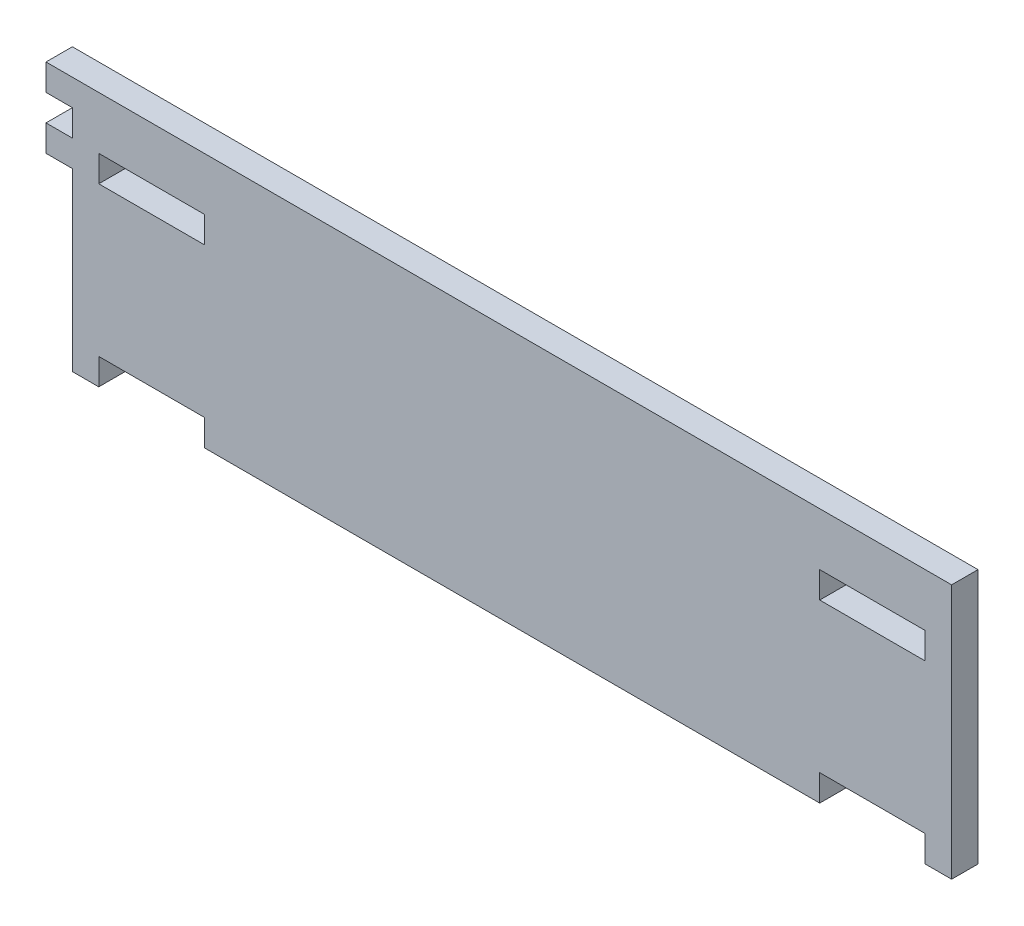
ISO-10303-21;
HEADER;
FILE_DESCRIPTION(('STEP AP214'),'2;1');
FILE_NAME('part.step','',(''),(''),'','','');
FILE_SCHEMA(('AUTOMOTIVE_DESIGN { 1 0 10303 214 1 1 1 1 }'));
ENDSEC;
DATA;
#1=APPLICATION_CONTEXT('core data for automotive mechanical design processes');
#2=APPLICATION_PROTOCOL_DEFINITION('international standard','automotive_design',2000,#1);
#3=PRODUCT_CONTEXT('',#1,'mechanical');
#4=PRODUCT('Part','Part','',(#3));
#5=PRODUCT_RELATED_PRODUCT_CATEGORY('part','',(#4));
#6=PRODUCT_DEFINITION_FORMATION('','',#4);
#7=PRODUCT_DEFINITION_CONTEXT('part definition',#1,'design');
#8=PRODUCT_DEFINITION('design','',#6,#7);
#9=PRODUCT_DEFINITION_SHAPE('','',#8);
#10=(LENGTH_UNIT() NAMED_UNIT(*) SI_UNIT(.MILLI.,.METRE.));
#11=(NAMED_UNIT(*) PLANE_ANGLE_UNIT() SI_UNIT($,.RADIAN.));
#12=(NAMED_UNIT(*) SI_UNIT($,.STERADIAN.) SOLID_ANGLE_UNIT());
#13=UNCERTAINTY_MEASURE_WITH_UNIT(LENGTH_MEASURE(1.E-05),#10,'distance_accuracy_value','');
#14=(GEOMETRIC_REPRESENTATION_CONTEXT(3) GLOBAL_UNCERTAINTY_ASSIGNED_CONTEXT((#13)) GLOBAL_UNIT_ASSIGNED_CONTEXT((#10,
#11,#12)) REPRESENTATION_CONTEXT('',''));
#15=CARTESIAN_POINT('',(0.,0.,0.));
#16=DIRECTION('',(0.,0.,1.));
#17=DIRECTION('',(1.,0.,0.));
#18=AXIS2_PLACEMENT_3D('',#15,#16,#17);
#19=CARTESIAN_POINT('',(0.,0.,3.));
#20=DIRECTION('',(1.,0.,0.));
#21=DIRECTION('',(0.,0.,-1.));
#22=AXIS2_PLACEMENT_3D('',#19,#20,#21);
#23=PLANE('',#22);
#24=DIRECTION('',(0.,0.,1.));
#25=VECTOR('',#24,1.);
#26=CARTESIAN_POINT('',(0.,20.,0.));
#27=LINE('',#26,#25);
#28=CARTESIAN_POINT('',(0.,20.,0.));
#29=VERTEX_POINT('',#28);
#30=CARTESIAN_POINT('',(0.,20.,3.));
#31=VERTEX_POINT('',#30);
#32=EDGE_CURVE('E259',#29,#31,#27,.T.);
#33=ORIENTED_EDGE('',*,*,#32,.F.);
#34=DIRECTION('',(0.,-1.,0.));
#35=VECTOR('',#34,1.);
#36=CARTESIAN_POINT('',(0.,0.,0.));
#37=LINE('',#36,#35);
#38=CARTESIAN_POINT('',(0.,0.,0.));
#39=VERTEX_POINT('',#38);
#40=EDGE_CURVE('E328',#29,#39,#37,.T.);
#41=ORIENTED_EDGE('',*,*,#40,.T.);
#42=DIRECTION('',(0.,0.,-1.));
#43=VECTOR('',#42,1.);
#44=CARTESIAN_POINT('',(0.,0.,3.));
#45=LINE('',#44,#43);
#46=CARTESIAN_POINT('',(0.,0.,3.));
#47=VERTEX_POINT('',#46);
#48=EDGE_CURVE('E11',#47,#39,#45,.T.);
#49=ORIENTED_EDGE('',*,*,#48,.F.);
#50=DIRECTION('',(0.,-1.,0.));
#51=VECTOR('',#50,1.);
#52=CARTESIAN_POINT('',(0.,0.,3.));
#53=LINE('',#52,#51);
#54=EDGE_CURVE('E216',#31,#47,#53,.T.);
#55=ORIENTED_EDGE('',*,*,#54,.F.);
#56=EDGE_LOOP('',(#33,#41,#49,#55));
#57=FACE_BOUND('',#56,.T.);
#58=ADVANCED_FACE('F33',(#57),#23,.F.);
#59=CARTESIAN_POINT('',(0.,0.,3.));
#60=DIRECTION('',(0.,0.,-1.));
#61=DIRECTION('',(-1.,0.,0.));
#62=AXIS2_PLACEMENT_3D('',#59,#60,#61);
#63=PLANE('',#62);
#64=DIRECTION('',(0.,-1.,0.));
#65=VECTOR('',#64,1.);
#66=CARTESIAN_POINT('',(3.,23.,3.));
#67=LINE('',#66,#65);
#68=CARTESIAN_POINT('',(3.,23.,3.));
#69=VERTEX_POINT('',#68);
#70=CARTESIAN_POINT('',(3.,20.,3.));
#71=VERTEX_POINT('',#70);
#72=EDGE_CURVE('E298',#69,#71,#67,.T.);
#73=ORIENTED_EDGE('',*,*,#72,.F.);
#74=DIRECTION('',(-1.,0.,0.));
#75=VECTOR('',#74,1.);
#76=CARTESIAN_POINT('',(3.,23.,3.));
#77=LINE('',#76,#75);
#78=CARTESIAN_POINT('',(15.,23.,3.));
#79=VERTEX_POINT('',#78);
#80=EDGE_CURVE('E306',#79,#69,#77,.T.);
#81=ORIENTED_EDGE('',*,*,#80,.F.);
#82=DIRECTION('',(0.,1.,0.));
#83=VECTOR('',#82,1.);
#84=CARTESIAN_POINT('',(15.,23.,3.));
#85=LINE('',#84,#83);
#86=CARTESIAN_POINT('',(15.,20.,3.));
#87=VERTEX_POINT('',#86);
#88=EDGE_CURVE('E303',#87,#79,#85,.T.);
#89=ORIENTED_EDGE('',*,*,#88,.F.);
#90=DIRECTION('',(1.,0.,0.));
#91=VECTOR('',#90,1.);
#92=CARTESIAN_POINT('',(3.,20.,3.));
#93=LINE('',#92,#91);
#94=EDGE_CURVE('E300',#71,#87,#93,.T.);
#95=ORIENTED_EDGE('',*,*,#94,.F.);
#96=EDGE_LOOP('',(#73,#81,#89,#95));
#97=FACE_BOUND('',#96,.T.);
#98=DIRECTION('',(-1.,0.,0.));
#99=VECTOR('',#98,1.);
#100=CARTESIAN_POINT('',(0.,29.,3.));
#101=LINE('',#100,#99);
#102=CARTESIAN_POINT('',(100.,29.,3.));
#103=VERTEX_POINT('',#102);
#104=CARTESIAN_POINT('',(-3.,29.,3.));
#105=VERTEX_POINT('',#104);
#106=EDGE_CURVE('E350',#103,#105,#101,.T.);
#107=ORIENTED_EDGE('',*,*,#106,.T.);
#108=DIRECTION('',(0.,-1.,0.));
#109=VECTOR('',#108,1.);
#110=CARTESIAN_POINT('',(-3.,29.,3.));
#111=LINE('',#110,#109);
#112=CARTESIAN_POINT('',(-3.,26.,3.));
#113=VERTEX_POINT('',#112);
#114=EDGE_CURVE('E225',#105,#113,#111,.T.);
#115=ORIENTED_EDGE('',*,*,#114,.T.);
#116=DIRECTION('',(1.,0.,0.));
#117=VECTOR('',#116,1.);
#118=CARTESIAN_POINT('',(0.,26.,3.));
#119=LINE('',#118,#117);
#120=CARTESIAN_POINT('',(0.,26.,3.));
#121=VERTEX_POINT('',#120);
#122=EDGE_CURVE('E232',#113,#121,#119,.T.);
#123=ORIENTED_EDGE('',*,*,#122,.T.);
#124=CARTESIAN_POINT('',(0.,23.,3.));
#125=VERTEX_POINT('',#124);
#126=EDGE_CURVE('E48',#121,#125,#53,.T.);
#127=ORIENTED_EDGE('',*,*,#126,.T.);
#128=DIRECTION('',(-1.,0.,0.));
#129=VECTOR('',#128,1.);
#130=CARTESIAN_POINT('',(0.,23.,3.));
#131=LINE('',#130,#129);
#132=CARTESIAN_POINT('',(-3.,23.,3.));
#133=VERTEX_POINT('',#132);
#134=EDGE_CURVE('E240',#125,#133,#131,.T.);
#135=ORIENTED_EDGE('',*,*,#134,.T.);
#136=DIRECTION('',(0.,-1.,0.));
#137=VECTOR('',#136,1.);
#138=CARTESIAN_POINT('',(-3.,23.,3.));
#139=LINE('',#138,#137);
#140=CARTESIAN_POINT('',(-3.,20.,3.));
#141=VERTEX_POINT('',#140);
#142=EDGE_CURVE('E254',#133,#141,#139,.T.);
#143=ORIENTED_EDGE('',*,*,#142,.T.);
#144=DIRECTION('',(1.,0.,0.));
#145=VECTOR('',#144,1.);
#146=CARTESIAN_POINT('',(0.,20.,3.));
#147=LINE('',#146,#145);
#148=EDGE_CURVE('E246',#141,#31,#147,.T.);
#149=ORIENTED_EDGE('',*,*,#148,.T.);
#150=ORIENTED_EDGE('',*,*,#54,.T.);
#151=DIRECTION('',(1.,0.,0.));
#152=VECTOR('',#151,1.);
#153=CARTESIAN_POINT('',(0.,0.,3.));
#154=LINE('',#153,#152);
#155=CARTESIAN_POINT('',(3.,0.,3.));
#156=VERTEX_POINT('',#155);
#157=EDGE_CURVE('E330',#47,#156,#154,.T.);
#158=ORIENTED_EDGE('',*,*,#157,.T.);
#159=DIRECTION('',(0.,1.,0.));
#160=VECTOR('',#159,1.);
#161=CARTESIAN_POINT('',(3.,0.,3.));
#162=LINE('',#161,#160);
#163=CARTESIAN_POINT('',(3.,3.,3.));
#164=VERTEX_POINT('',#163);
#165=EDGE_CURVE('E332',#156,#164,#162,.T.);
#166=ORIENTED_EDGE('',*,*,#165,.T.);
#167=DIRECTION('',(1.,0.,0.));
#168=VECTOR('',#167,1.);
#169=CARTESIAN_POINT('',(3.,3.,3.));
#170=LINE('',#169,#168);
#171=CARTESIAN_POINT('',(15.,3.,3.));
#172=VERTEX_POINT('',#171);
#173=EDGE_CURVE('E334',#164,#172,#170,.T.);
#174=ORIENTED_EDGE('',*,*,#173,.T.);
#175=DIRECTION('',(0.,-1.,0.));
#176=VECTOR('',#175,1.);
#177=CARTESIAN_POINT('',(15.,0.,3.));
#178=LINE('',#177,#176);
#179=CARTESIAN_POINT('',(15.,0.,3.));
#180=VERTEX_POINT('',#179);
#181=EDGE_CURVE('E336',#172,#180,#178,.T.);
#182=ORIENTED_EDGE('',*,*,#181,.T.);
#183=DIRECTION('',(1.,0.,0.));
#184=VECTOR('',#183,1.);
#185=CARTESIAN_POINT('',(15.,0.,3.));
#186=LINE('',#185,#184);
#187=CARTESIAN_POINT('',(85.,0.,3.));
#188=VERTEX_POINT('',#187);
#189=EDGE_CURVE('E338',#180,#188,#186,.T.);
#190=ORIENTED_EDGE('',*,*,#189,.T.);
#191=DIRECTION('',(0.,1.,0.));
#192=VECTOR('',#191,1.);
#193=CARTESIAN_POINT('',(85.,0.,3.));
#194=LINE('',#193,#192);
#195=CARTESIAN_POINT('',(85.,3.,3.));
#196=VERTEX_POINT('',#195);
#197=EDGE_CURVE('E340',#188,#196,#194,.T.);
#198=ORIENTED_EDGE('',*,*,#197,.T.);
#199=DIRECTION('',(1.,0.,0.));
#200=VECTOR('',#199,1.);
#201=CARTESIAN_POINT('',(85.,3.,3.));
#202=LINE('',#201,#200);
#203=CARTESIAN_POINT('',(97.,3.,3.));
#204=VERTEX_POINT('',#203);
#205=EDGE_CURVE('E342',#196,#204,#202,.T.);
#206=ORIENTED_EDGE('',*,*,#205,.T.);
#207=DIRECTION('',(0.,-1.,0.));
#208=VECTOR('',#207,1.);
#209=CARTESIAN_POINT('',(97.,0.,3.));
#210=LINE('',#209,#208);
#211=CARTESIAN_POINT('',(97.,0.,3.));
#212=VERTEX_POINT('',#211);
#213=EDGE_CURVE('E344',#204,#212,#210,.T.);
#214=ORIENTED_EDGE('',*,*,#213,.T.);
#215=DIRECTION('',(1.,0.,0.));
#216=VECTOR('',#215,1.);
#217=CARTESIAN_POINT('',(97.,0.,3.));
#218=LINE('',#217,#216);
#219=CARTESIAN_POINT('',(100.,0.,3.));
#220=VERTEX_POINT('',#219);
#221=EDGE_CURVE('E346',#212,#220,#218,.T.);
#222=ORIENTED_EDGE('',*,*,#221,.T.);
#223=DIRECTION('',(0.,1.,0.));
#224=VECTOR('',#223,1.);
#225=CARTESIAN_POINT('',(100.,0.,3.));
#226=LINE('',#225,#224);
#227=EDGE_CURVE('E348',#220,#103,#226,.T.);
#228=ORIENTED_EDGE('',*,*,#227,.T.);
#229=EDGE_LOOP('',(#107,#115,#123,#127,#135,#143,#149,#150,#158,#166,#174,#182,#190,#198,#206,
#214,#222,#228));
#230=FACE_BOUND('',#229,.T.);
#231=DIRECTION('',(0.,-1.,0.));
#232=VECTOR('',#231,1.);
#233=CARTESIAN_POINT('',(85.,23.,3.));
#234=LINE('',#233,#232);
#235=CARTESIAN_POINT('',(85.,23.,3.));
#236=VERTEX_POINT('',#235);
#237=CARTESIAN_POINT('',(85.,20.,3.));
#238=VERTEX_POINT('',#237);
#239=EDGE_CURVE('E267',#236,#238,#234,.T.);
#240=ORIENTED_EDGE('',*,*,#239,.F.);
#241=DIRECTION('',(-1.,0.,0.));
#242=VECTOR('',#241,1.);
#243=CARTESIAN_POINT('',(85.,23.,3.));
#244=LINE('',#243,#242);
#245=CARTESIAN_POINT('',(97.,23.,3.));
#246=VERTEX_POINT('',#245);
#247=EDGE_CURVE('E275',#246,#236,#244,.T.);
#248=ORIENTED_EDGE('',*,*,#247,.F.);
#249=DIRECTION('',(0.,1.,0.));
#250=VECTOR('',#249,1.);
#251=CARTESIAN_POINT('',(97.,23.,3.));
#252=LINE('',#251,#250);
#253=CARTESIAN_POINT('',(97.,20.,3.));
#254=VERTEX_POINT('',#253);
#255=EDGE_CURVE('E272',#254,#246,#252,.T.);
#256=ORIENTED_EDGE('',*,*,#255,.F.);
#257=DIRECTION('',(1.,0.,0.));
#258=VECTOR('',#257,1.);
#259=CARTESIAN_POINT('',(85.,20.,3.));
#260=LINE('',#259,#258);
#261=EDGE_CURVE('E269',#238,#254,#260,.T.);
#262=ORIENTED_EDGE('',*,*,#261,.F.);
#263=EDGE_LOOP('',(#240,#248,#256,#262));
#264=FACE_BOUND('',#263,.T.);
#265=ADVANCED_FACE('F421',(#97,#230,#264),#63,.F.);
#266=CARTESIAN_POINT('',(0.,0.,0.));
#267=DIRECTION('',(0.,0.,-1.));
#268=DIRECTION('',(-1.,0.,0.));
#269=AXIS2_PLACEMENT_3D('',#266,#267,#268);
#270=PLANE('',#269);
#271=CARTESIAN_POINT('',(0.,26.,0.));
#272=VERTEX_POINT('',#271);
#273=CARTESIAN_POINT('',(0.,23.,0.));
#274=VERTEX_POINT('',#273);
#275=EDGE_CURVE('E352',#272,#274,#37,.T.);
#276=ORIENTED_EDGE('',*,*,#275,.F.);
#277=DIRECTION('',(1.,0.,0.));
#278=VECTOR('',#277,1.);
#279=CARTESIAN_POINT('',(0.,26.,0.));
#280=LINE('',#279,#278);
#281=CARTESIAN_POINT('',(-3.,26.,0.));
#282=VERTEX_POINT('',#281);
#283=EDGE_CURVE('E227',#282,#272,#280,.T.);
#284=ORIENTED_EDGE('',*,*,#283,.F.);
#285=DIRECTION('',(0.,-1.,0.));
#286=VECTOR('',#285,1.);
#287=CARTESIAN_POINT('',(-3.,29.,0.));
#288=LINE('',#287,#286);
#289=CARTESIAN_POINT('',(-3.,29.,0.));
#290=VERTEX_POINT('',#289);
#291=EDGE_CURVE('E222',#290,#282,#288,.T.);
#292=ORIENTED_EDGE('',*,*,#291,.F.);
#293=DIRECTION('',(-1.,0.,0.));
#294=VECTOR('',#293,1.);
#295=CARTESIAN_POINT('',(0.,29.,0.));
#296=LINE('',#295,#294);
#297=CARTESIAN_POINT('',(100.,29.,0.));
#298=VERTEX_POINT('',#297);
#299=EDGE_CURVE('E205',#298,#290,#296,.T.);
#300=ORIENTED_EDGE('',*,*,#299,.F.);
#301=DIRECTION('',(0.,1.,0.));
#302=VECTOR('',#301,1.);
#303=CARTESIAN_POINT('',(100.,0.,0.));
#304=LINE('',#303,#302);
#305=CARTESIAN_POINT('',(100.,0.,0.));
#306=VERTEX_POINT('',#305);
#307=EDGE_CURVE('E217',#306,#298,#304,.T.);
#308=ORIENTED_EDGE('',*,*,#307,.F.);
#309=DIRECTION('',(1.,0.,0.));
#310=VECTOR('',#309,1.);
#311=CARTESIAN_POINT('',(97.,0.,0.));
#312=LINE('',#311,#310);
#313=CARTESIAN_POINT('',(97.,0.,0.));
#314=VERTEX_POINT('',#313);
#315=EDGE_CURVE('E370',#314,#306,#312,.T.);
#316=ORIENTED_EDGE('',*,*,#315,.F.);
#317=DIRECTION('',(0.,-1.,0.));
#318=VECTOR('',#317,1.);
#319=CARTESIAN_POINT('',(97.,0.,0.));
#320=LINE('',#319,#318);
#321=CARTESIAN_POINT('',(97.,3.,0.));
#322=VERTEX_POINT('',#321);
#323=EDGE_CURVE('E368',#322,#314,#320,.T.);
#324=ORIENTED_EDGE('',*,*,#323,.F.);
#325=DIRECTION('',(1.,0.,0.));
#326=VECTOR('',#325,1.);
#327=CARTESIAN_POINT('',(85.,3.,0.));
#328=LINE('',#327,#326);
#329=CARTESIAN_POINT('',(85.,3.,0.));
#330=VERTEX_POINT('',#329);
#331=EDGE_CURVE('E366',#330,#322,#328,.T.);
#332=ORIENTED_EDGE('',*,*,#331,.F.);
#333=DIRECTION('',(0.,1.,0.));
#334=VECTOR('',#333,1.);
#335=CARTESIAN_POINT('',(85.,0.,0.));
#336=LINE('',#335,#334);
#337=CARTESIAN_POINT('',(85.,0.,0.));
#338=VERTEX_POINT('',#337);
#339=EDGE_CURVE('E364',#338,#330,#336,.T.);
#340=ORIENTED_EDGE('',*,*,#339,.F.);
#341=DIRECTION('',(1.,0.,0.));
#342=VECTOR('',#341,1.);
#343=CARTESIAN_POINT('',(15.,0.,0.));
#344=LINE('',#343,#342);
#345=CARTESIAN_POINT('',(15.,0.,0.));
#346=VERTEX_POINT('',#345);
#347=EDGE_CURVE('E362',#346,#338,#344,.T.);
#348=ORIENTED_EDGE('',*,*,#347,.F.);
#349=DIRECTION('',(0.,-1.,0.));
#350=VECTOR('',#349,1.);
#351=CARTESIAN_POINT('',(15.,0.,0.));
#352=LINE('',#351,#350);
#353=CARTESIAN_POINT('',(15.,3.,0.));
#354=VERTEX_POINT('',#353);
#355=EDGE_CURVE('E360',#354,#346,#352,.T.);
#356=ORIENTED_EDGE('',*,*,#355,.F.);
#357=DIRECTION('',(1.,0.,0.));
#358=VECTOR('',#357,1.);
#359=CARTESIAN_POINT('',(3.,3.,0.));
#360=LINE('',#359,#358);
#361=CARTESIAN_POINT('',(3.,3.,0.));
#362=VERTEX_POINT('',#361);
#363=EDGE_CURVE('E358',#362,#354,#360,.T.);
#364=ORIENTED_EDGE('',*,*,#363,.F.);
#365=DIRECTION('',(0.,1.,0.));
#366=VECTOR('',#365,1.);
#367=CARTESIAN_POINT('',(3.,0.,0.));
#368=LINE('',#367,#366);
#369=CARTESIAN_POINT('',(3.,0.,0.));
#370=VERTEX_POINT('',#369);
#371=EDGE_CURVE('E356',#370,#362,#368,.T.);
#372=ORIENTED_EDGE('',*,*,#371,.F.);
#373=DIRECTION('',(1.,0.,0.));
#374=VECTOR('',#373,1.);
#375=CARTESIAN_POINT('',(0.,0.,0.));
#376=LINE('',#375,#374);
#377=EDGE_CURVE('E354',#39,#370,#376,.T.);
#378=ORIENTED_EDGE('',*,*,#377,.F.);
#379=ORIENTED_EDGE('',*,*,#40,.F.);
#380=DIRECTION('',(1.,0.,0.));
#381=VECTOR('',#380,1.);
#382=CARTESIAN_POINT('',(0.,20.,0.));
#383=LINE('',#382,#381);
#384=CARTESIAN_POINT('',(-3.,20.,0.));
#385=VERTEX_POINT('',#384);
#386=EDGE_CURVE('E249',#385,#29,#383,.T.);
#387=ORIENTED_EDGE('',*,*,#386,.F.);
#388=DIRECTION('',(0.,-1.,0.));
#389=VECTOR('',#388,1.);
#390=CARTESIAN_POINT('',(-3.,23.,0.));
#391=LINE('',#390,#389);
#392=CARTESIAN_POINT('',(-3.,23.,0.));
#393=VERTEX_POINT('',#392);
#394=EDGE_CURVE('E245',#393,#385,#391,.T.);
#395=ORIENTED_EDGE('',*,*,#394,.F.);
#396=DIRECTION('',(-1.,0.,0.));
#397=VECTOR('',#396,1.);
#398=CARTESIAN_POINT('',(0.,23.,0.));
#399=LINE('',#398,#397);
#400=EDGE_CURVE('E242',#274,#393,#399,.T.);
#401=ORIENTED_EDGE('',*,*,#400,.F.);
#402=EDGE_LOOP('',(#276,#284,#292,#300,#308,#316,#324,#332,#340,#348,#356,#364,#372,#378,#379,
#387,#395,#401));
#403=FACE_BOUND('',#402,.T.);
#404=DIRECTION('',(-1.,0.,0.));
#405=VECTOR('',#404,1.);
#406=CARTESIAN_POINT('',(3.,23.,0.));
#407=LINE('',#406,#405);
#408=CARTESIAN_POINT('',(15.,23.,0.));
#409=VERTEX_POINT('',#408);
#410=CARTESIAN_POINT('',(3.,23.,0.));
#411=VERTEX_POINT('',#410);
#412=EDGE_CURVE('E301',#409,#411,#407,.T.);
#413=ORIENTED_EDGE('',*,*,#412,.T.);
#414=DIRECTION('',(0.,-1.,0.));
#415=VECTOR('',#414,1.);
#416=CARTESIAN_POINT('',(3.,23.,0.));
#417=LINE('',#416,#415);
#418=CARTESIAN_POINT('',(3.,20.,0.));
#419=VERTEX_POINT('',#418);
#420=EDGE_CURVE('E297',#411,#419,#417,.T.);
#421=ORIENTED_EDGE('',*,*,#420,.T.);
#422=DIRECTION('',(1.,0.,0.));
#423=VECTOR('',#422,1.);
#424=CARTESIAN_POINT('',(3.,20.,0.));
#425=LINE('',#424,#423);
#426=CARTESIAN_POINT('',(15.,20.,0.));
#427=VERTEX_POINT('',#426);
#428=EDGE_CURVE('E311',#419,#427,#425,.T.);
#429=ORIENTED_EDGE('',*,*,#428,.T.);
#430=DIRECTION('',(0.,1.,0.));
#431=VECTOR('',#430,1.);
#432=CARTESIAN_POINT('',(15.,23.,0.));
#433=LINE('',#432,#431);
#434=EDGE_CURVE('E314',#427,#409,#433,.T.);
#435=ORIENTED_EDGE('',*,*,#434,.T.);
#436=EDGE_LOOP('',(#413,#421,#429,#435));
#437=FACE_BOUND('',#436,.T.);
#438=DIRECTION('',(-1.,0.,0.));
#439=VECTOR('',#438,1.);
#440=CARTESIAN_POINT('',(85.,23.,0.));
#441=LINE('',#440,#439);
#442=CARTESIAN_POINT('',(97.,23.,0.));
#443=VERTEX_POINT('',#442);
#444=CARTESIAN_POINT('',(85.,23.,0.));
#445=VERTEX_POINT('',#444);
#446=EDGE_CURVE('E270',#443,#445,#441,.T.);
#447=ORIENTED_EDGE('',*,*,#446,.T.);
#448=DIRECTION('',(0.,-1.,0.));
#449=VECTOR('',#448,1.);
#450=CARTESIAN_POINT('',(85.,23.,0.));
#451=LINE('',#450,#449);
#452=CARTESIAN_POINT('',(85.,20.,0.));
#453=VERTEX_POINT('',#452);
#454=EDGE_CURVE('E261',#445,#453,#451,.T.);
#455=ORIENTED_EDGE('',*,*,#454,.T.);
#456=DIRECTION('',(1.,0.,0.));
#457=VECTOR('',#456,1.);
#458=CARTESIAN_POINT('',(85.,20.,0.));
#459=LINE('',#458,#457);
#460=CARTESIAN_POINT('',(97.,20.,0.));
#461=VERTEX_POINT('',#460);
#462=EDGE_CURVE('E280',#453,#461,#459,.T.);
#463=ORIENTED_EDGE('',*,*,#462,.T.);
#464=DIRECTION('',(0.,1.,0.));
#465=VECTOR('',#464,1.);
#466=CARTESIAN_POINT('',(97.,23.,0.));
#467=LINE('',#466,#465);
#468=EDGE_CURVE('E283',#461,#443,#467,.T.);
#469=ORIENTED_EDGE('',*,*,#468,.T.);
#470=EDGE_LOOP('',(#447,#455,#463,#469));
#471=FACE_BOUND('',#470,.T.);
#472=ADVANCED_FACE('F229',(#403,#437,#471),#270,.T.);
#473=ORIENTED_EDGE('',*,*,#126,.F.);
#474=DIRECTION('',(0.,0.,1.));
#475=VECTOR('',#474,1.);
#476=CARTESIAN_POINT('',(0.,26.,0.));
#477=LINE('',#476,#475);
#478=EDGE_CURVE('E52',#272,#121,#477,.T.);
#479=ORIENTED_EDGE('',*,*,#478,.F.);
#480=ORIENTED_EDGE('',*,*,#275,.T.);
#481=DIRECTION('',(0.,0.,1.));
#482=VECTOR('',#481,1.);
#483=CARTESIAN_POINT('',(0.,23.,0.));
#484=LINE('',#483,#482);
#485=EDGE_CURVE('E251',#274,#125,#484,.T.);
#486=ORIENTED_EDGE('',*,*,#485,.T.);
#487=EDGE_LOOP('',(#473,#479,#480,#486));
#488=FACE_BOUND('',#487,.T.);
#489=ADVANCED_FACE('F35',(#488),#23,.F.);
#490=CARTESIAN_POINT('',(0.,0.,3.));
#491=DIRECTION('',(0.,1.,0.));
#492=DIRECTION('',(0.,0.,1.));
#493=AXIS2_PLACEMENT_3D('',#490,#491,#492);
#494=PLANE('',#493);
#495=ORIENTED_EDGE('',*,*,#377,.T.);
#496=DIRECTION('',(0.,0.,-1.));
#497=VECTOR('',#496,1.);
#498=CARTESIAN_POINT('',(3.,0.,3.));
#499=LINE('',#498,#497);
#500=EDGE_CURVE('E41',#156,#370,#499,.T.);
#501=ORIENTED_EDGE('',*,*,#500,.F.);
#502=ORIENTED_EDGE('',*,*,#157,.F.);
#503=ORIENTED_EDGE('',*,*,#48,.T.);
#504=EDGE_LOOP('',(#495,#501,#502,#503));
#505=FACE_BOUND('',#504,.T.);
#506=ADVANCED_FACE('F426',(#505),#494,.F.);
#507=CARTESIAN_POINT('',(3.,0.,3.));
#508=DIRECTION('',(-1.,0.,0.));
#509=DIRECTION('',(0.,0.,1.));
#510=AXIS2_PLACEMENT_3D('',#507,#508,#509);
#511=PLANE('',#510);
#512=ORIENTED_EDGE('',*,*,#371,.T.);
#513=DIRECTION('',(0.,0.,-1.));
#514=VECTOR('',#513,1.);
#515=CARTESIAN_POINT('',(3.,3.,3.));
#516=LINE('',#515,#514);
#517=EDGE_CURVE('E395',#164,#362,#516,.T.);
#518=ORIENTED_EDGE('',*,*,#517,.F.);
#519=ORIENTED_EDGE('',*,*,#165,.F.);
#520=ORIENTED_EDGE('',*,*,#500,.T.);
#521=EDGE_LOOP('',(#512,#518,#519,#520));
#522=FACE_BOUND('',#521,.T.);
#523=ADVANCED_FACE('F402',(#522),#511,.F.);
#524=CARTESIAN_POINT('',(3.,3.,3.));
#525=DIRECTION('',(0.,1.,0.));
#526=DIRECTION('',(0.,0.,1.));
#527=AXIS2_PLACEMENT_3D('',#524,#525,#526);
#528=PLANE('',#527);
#529=ORIENTED_EDGE('',*,*,#363,.T.);
#530=DIRECTION('',(0.,0.,-1.));
#531=VECTOR('',#530,1.);
#532=CARTESIAN_POINT('',(15.,3.,3.));
#533=LINE('',#532,#531);
#534=EDGE_CURVE('E392',#172,#354,#533,.T.);
#535=ORIENTED_EDGE('',*,*,#534,.F.);
#536=ORIENTED_EDGE('',*,*,#173,.F.);
#537=ORIENTED_EDGE('',*,*,#517,.T.);
#538=EDGE_LOOP('',(#529,#535,#536,#537));
#539=FACE_BOUND('',#538,.T.);
#540=ADVANCED_FACE('F413',(#539),#528,.F.);
#541=CARTESIAN_POINT('',(15.,0.,3.));
#542=DIRECTION('',(1.,0.,0.));
#543=DIRECTION('',(0.,0.,-1.));
#544=AXIS2_PLACEMENT_3D('',#541,#542,#543);
#545=PLANE('',#544);
#546=ORIENTED_EDGE('',*,*,#355,.T.);
#547=DIRECTION('',(0.,0.,-1.));
#548=VECTOR('',#547,1.);
#549=CARTESIAN_POINT('',(15.,0.,3.));
#550=LINE('',#549,#548);
#551=EDGE_CURVE('E389',#180,#346,#550,.T.);
#552=ORIENTED_EDGE('',*,*,#551,.F.);
#553=ORIENTED_EDGE('',*,*,#181,.F.);
#554=ORIENTED_EDGE('',*,*,#534,.T.);
#555=EDGE_LOOP('',(#546,#552,#553,#554));
#556=FACE_BOUND('',#555,.T.);
#557=ADVANCED_FACE('F417',(#556),#545,.F.);
#558=CARTESIAN_POINT('',(15.,0.,3.));
#559=DIRECTION('',(0.,1.,0.));
#560=DIRECTION('',(0.,0.,1.));
#561=AXIS2_PLACEMENT_3D('',#558,#559,#560);
#562=PLANE('',#561);
#563=ORIENTED_EDGE('',*,*,#347,.T.);
#564=DIRECTION('',(0.,0.,-1.));
#565=VECTOR('',#564,1.);
#566=CARTESIAN_POINT('',(85.,0.,3.));
#567=LINE('',#566,#565);
#568=EDGE_CURVE('E386',#188,#338,#567,.T.);
#569=ORIENTED_EDGE('',*,*,#568,.F.);
#570=ORIENTED_EDGE('',*,*,#189,.F.);
#571=ORIENTED_EDGE('',*,*,#551,.T.);
#572=EDGE_LOOP('',(#563,#569,#570,#571));
#573=FACE_BOUND('',#572,.T.);
#574=ADVANCED_FACE('F469',(#573),#562,.F.);
#575=CARTESIAN_POINT('',(85.,0.,3.));
#576=DIRECTION('',(-1.,0.,0.));
#577=DIRECTION('',(0.,0.,1.));
#578=AXIS2_PLACEMENT_3D('',#575,#576,#577);
#579=PLANE('',#578);
#580=ORIENTED_EDGE('',*,*,#339,.T.);
#581=DIRECTION('',(0.,0.,-1.));
#582=VECTOR('',#581,1.);
#583=CARTESIAN_POINT('',(85.,3.,3.));
#584=LINE('',#583,#582);
#585=EDGE_CURVE('E383',#196,#330,#584,.T.);
#586=ORIENTED_EDGE('',*,*,#585,.F.);
#587=ORIENTED_EDGE('',*,*,#197,.F.);
#588=ORIENTED_EDGE('',*,*,#568,.T.);
#589=EDGE_LOOP('',(#580,#586,#587,#588));
#590=FACE_BOUND('',#589,.T.);
#591=ADVANCED_FACE('F466',(#590),#579,.F.);
#592=CARTESIAN_POINT('',(85.,3.,3.));
#593=DIRECTION('',(0.,1.,0.));
#594=DIRECTION('',(0.,0.,1.));
#595=AXIS2_PLACEMENT_3D('',#592,#593,#594);
#596=PLANE('',#595);
#597=ORIENTED_EDGE('',*,*,#331,.T.);
#598=DIRECTION('',(0.,0.,-1.));
#599=VECTOR('',#598,1.);
#600=CARTESIAN_POINT('',(97.,3.,3.));
#601=LINE('',#600,#599);
#602=EDGE_CURVE('E380',#204,#322,#601,.T.);
#603=ORIENTED_EDGE('',*,*,#602,.F.);
#604=ORIENTED_EDGE('',*,*,#205,.F.);
#605=ORIENTED_EDGE('',*,*,#585,.T.);
#606=EDGE_LOOP('',(#597,#603,#604,#605));
#607=FACE_BOUND('',#606,.T.);
#608=ADVANCED_FACE('F462',(#607),#596,.F.);
#609=CARTESIAN_POINT('',(97.,0.,3.));
#610=DIRECTION('',(1.,0.,0.));
#611=DIRECTION('',(0.,0.,-1.));
#612=AXIS2_PLACEMENT_3D('',#609,#610,#611);
#613=PLANE('',#612);
#614=ORIENTED_EDGE('',*,*,#323,.T.);
#615=DIRECTION('',(0.,0.,-1.));
#616=VECTOR('',#615,1.);
#617=CARTESIAN_POINT('',(97.,0.,3.));
#618=LINE('',#617,#616);
#619=EDGE_CURVE('E377',#212,#314,#618,.T.);
#620=ORIENTED_EDGE('',*,*,#619,.F.);
#621=ORIENTED_EDGE('',*,*,#213,.F.);
#622=ORIENTED_EDGE('',*,*,#602,.T.);
#623=EDGE_LOOP('',(#614,#620,#621,#622));
#624=FACE_BOUND('',#623,.T.);
#625=ADVANCED_FACE('F458',(#624),#613,.F.);
#626=CARTESIAN_POINT('',(97.,0.,3.));
#627=DIRECTION('',(0.,1.,0.));
#628=DIRECTION('',(0.,0.,1.));
#629=AXIS2_PLACEMENT_3D('',#626,#627,#628);
#630=PLANE('',#629);
#631=ORIENTED_EDGE('',*,*,#315,.T.);
#632=DIRECTION('',(0.,0.,-1.));
#633=VECTOR('',#632,1.);
#634=CARTESIAN_POINT('',(100.,0.,3.));
#635=LINE('',#634,#633);
#636=EDGE_CURVE('E374',#220,#306,#635,.T.);
#637=ORIENTED_EDGE('',*,*,#636,.F.);
#638=ORIENTED_EDGE('',*,*,#221,.F.);
#639=ORIENTED_EDGE('',*,*,#619,.T.);
#640=EDGE_LOOP('',(#631,#637,#638,#639));
#641=FACE_BOUND('',#640,.T.);
#642=ADVANCED_FACE('F454',(#641),#630,.F.);
#643=CARTESIAN_POINT('',(100.,0.,3.));
#644=DIRECTION('',(-1.,0.,0.));
#645=DIRECTION('',(0.,-1.,0.));
#646=AXIS2_PLACEMENT_3D('',#643,#644,#645);
#647=PLANE('',#646);
#648=ORIENTED_EDGE('',*,*,#307,.T.);
#649=DIRECTION('',(0.,0.,-1.));
#650=VECTOR('',#649,1.);
#651=CARTESIAN_POINT('',(100.,29.,3.));
#652=LINE('',#651,#650);
#653=EDGE_CURVE('E212',#103,#298,#652,.T.);
#654=ORIENTED_EDGE('',*,*,#653,.F.);
#655=ORIENTED_EDGE('',*,*,#227,.F.);
#656=ORIENTED_EDGE('',*,*,#636,.T.);
#657=EDGE_LOOP('',(#648,#654,#655,#656));
#658=FACE_BOUND('',#657,.T.);
#659=ADVANCED_FACE('F449',(#658),#647,.F.);
#660=CARTESIAN_POINT('',(0.,29.,3.));
#661=DIRECTION('',(0.,-1.,0.));
#662=DIRECTION('',(0.,0.,-1.));
#663=AXIS2_PLACEMENT_3D('',#660,#661,#662);
#664=PLANE('',#663);
#665=ORIENTED_EDGE('',*,*,#299,.T.);
#666=DIRECTION('',(0.,0.,1.));
#667=VECTOR('',#666,1.);
#668=CARTESIAN_POINT('',(-3.,29.,0.));
#669=LINE('',#668,#667);
#670=EDGE_CURVE('E209',#290,#105,#669,.T.);
#671=ORIENTED_EDGE('',*,*,#670,.T.);
#672=ORIENTED_EDGE('',*,*,#106,.F.);
#673=ORIENTED_EDGE('',*,*,#653,.T.);
#674=EDGE_LOOP('',(#665,#671,#672,#673));
#675=FACE_BOUND('',#674,.T.);
#676=ADVANCED_FACE('F207',(#675),#664,.F.);
#677=CARTESIAN_POINT('',(3.,23.,3.));
#678=DIRECTION('',(1.,0.,0.));
#679=DIRECTION('',(0.,1.,0.));
#680=AXIS2_PLACEMENT_3D('',#677,#678,#679);
#681=PLANE('',#680);
#682=ORIENTED_EDGE('',*,*,#420,.F.);
#683=DIRECTION('',(0.,0.,-1.));
#684=VECTOR('',#683,1.);
#685=CARTESIAN_POINT('',(3.,23.,3.));
#686=LINE('',#685,#684);
#687=EDGE_CURVE('E308',#69,#411,#686,.T.);
#688=ORIENTED_EDGE('',*,*,#687,.F.);
#689=ORIENTED_EDGE('',*,*,#72,.T.);
#690=DIRECTION('',(0.,0.,-1.));
#691=VECTOR('',#690,1.);
#692=CARTESIAN_POINT('',(3.,20.,3.));
#693=LINE('',#692,#691);
#694=EDGE_CURVE('E325',#71,#419,#693,.T.);
#695=ORIENTED_EDGE('',*,*,#694,.T.);
#696=EDGE_LOOP('',(#682,#688,#689,#695));
#697=FACE_BOUND('',#696,.T.);
#698=ADVANCED_FACE('F496',(#697),#681,.T.);
#699=CARTESIAN_POINT('',(3.,20.,3.));
#700=DIRECTION('',(0.,1.,0.));
#701=DIRECTION('',(0.,0.,1.));
#702=AXIS2_PLACEMENT_3D('',#699,#700,#701);
#703=PLANE('',#702);
#704=ORIENTED_EDGE('',*,*,#428,.F.);
#705=ORIENTED_EDGE('',*,*,#694,.F.);
#706=ORIENTED_EDGE('',*,*,#94,.T.);
#707=DIRECTION('',(0.,0.,-1.));
#708=VECTOR('',#707,1.);
#709=CARTESIAN_POINT('',(15.,20.,3.));
#710=LINE('',#709,#708);
#711=EDGE_CURVE('E323',#87,#427,#710,.T.);
#712=ORIENTED_EDGE('',*,*,#711,.T.);
#713=EDGE_LOOP('',(#704,#705,#706,#712));
#714=FACE_BOUND('',#713,.T.);
#715=ADVANCED_FACE('F531',(#714),#703,.T.);
#716=CARTESIAN_POINT('',(15.,23.,3.));
#717=DIRECTION('',(-1.,0.,0.));
#718=DIRECTION('',(0.,0.,1.));
#719=AXIS2_PLACEMENT_3D('',#716,#717,#718);
#720=PLANE('',#719);
#721=ORIENTED_EDGE('',*,*,#434,.F.);
#722=ORIENTED_EDGE('',*,*,#711,.F.);
#723=ORIENTED_EDGE('',*,*,#88,.T.);
#724=DIRECTION('',(0.,0.,-1.));
#725=VECTOR('',#724,1.);
#726=CARTESIAN_POINT('',(15.,23.,3.));
#727=LINE('',#726,#725);
#728=EDGE_CURVE('E321',#79,#409,#727,.T.);
#729=ORIENTED_EDGE('',*,*,#728,.T.);
#730=EDGE_LOOP('',(#721,#722,#723,#729));
#731=FACE_BOUND('',#730,.T.);
#732=ADVANCED_FACE('F538',(#731),#720,.T.);
#733=CARTESIAN_POINT('',(3.,23.,3.));
#734=DIRECTION('',(0.,-1.,0.));
#735=DIRECTION('',(1.,0.,0.));
#736=AXIS2_PLACEMENT_3D('',#733,#734,#735);
#737=PLANE('',#736);
#738=ORIENTED_EDGE('',*,*,#412,.F.);
#739=ORIENTED_EDGE('',*,*,#728,.F.);
#740=ORIENTED_EDGE('',*,*,#80,.T.);
#741=ORIENTED_EDGE('',*,*,#687,.T.);
#742=EDGE_LOOP('',(#738,#739,#740,#741));
#743=FACE_BOUND('',#742,.T.);
#744=ADVANCED_FACE('F546',(#743),#737,.T.);
#745=CARTESIAN_POINT('',(85.,23.,3.));
#746=DIRECTION('',(1.,0.,0.));
#747=DIRECTION('',(0.,0.,-1.));
#748=AXIS2_PLACEMENT_3D('',#745,#746,#747);
#749=PLANE('',#748);
#750=ORIENTED_EDGE('',*,*,#454,.F.);
#751=DIRECTION('',(0.,0.,-1.));
#752=VECTOR('',#751,1.);
#753=CARTESIAN_POINT('',(85.,23.,3.));
#754=LINE('',#753,#752);
#755=EDGE_CURVE('E277',#236,#445,#754,.T.);
#756=ORIENTED_EDGE('',*,*,#755,.F.);
#757=ORIENTED_EDGE('',*,*,#239,.T.);
#758=DIRECTION('',(0.,0.,-1.));
#759=VECTOR('',#758,1.);
#760=CARTESIAN_POINT('',(85.,20.,3.));
#761=LINE('',#760,#759);
#762=EDGE_CURVE('E294',#238,#453,#761,.T.);
#763=ORIENTED_EDGE('',*,*,#762,.T.);
#764=EDGE_LOOP('',(#750,#756,#757,#763));
#765=FACE_BOUND('',#764,.T.);
#766=ADVANCED_FACE('F554',(#765),#749,.T.);
#767=CARTESIAN_POINT('',(85.,20.,3.));
#768=DIRECTION('',(0.,1.,0.));
#769=DIRECTION('',(-1.,0.,0.));
#770=AXIS2_PLACEMENT_3D('',#767,#768,#769);
#771=PLANE('',#770);
#772=ORIENTED_EDGE('',*,*,#462,.F.);
#773=ORIENTED_EDGE('',*,*,#762,.F.);
#774=ORIENTED_EDGE('',*,*,#261,.T.);
#775=DIRECTION('',(0.,0.,-1.));
#776=VECTOR('',#775,1.);
#777=CARTESIAN_POINT('',(97.,20.,3.));
#778=LINE('',#777,#776);
#779=EDGE_CURVE('E292',#254,#461,#778,.T.);
#780=ORIENTED_EDGE('',*,*,#779,.T.);
#781=EDGE_LOOP('',(#772,#773,#774,#780));
#782=FACE_BOUND('',#781,.T.);
#783=ADVANCED_FACE('F562',(#782),#771,.T.);
#784=CARTESIAN_POINT('',(97.,23.,3.));
#785=DIRECTION('',(-1.,0.,0.));
#786=DIRECTION('',(0.,0.,1.));
#787=AXIS2_PLACEMENT_3D('',#784,#785,#786);
#788=PLANE('',#787);
#789=ORIENTED_EDGE('',*,*,#468,.F.);
#790=ORIENTED_EDGE('',*,*,#779,.F.);
#791=ORIENTED_EDGE('',*,*,#255,.T.);
#792=DIRECTION('',(0.,0.,-1.));
#793=VECTOR('',#792,1.);
#794=CARTESIAN_POINT('',(97.,23.,3.));
#795=LINE('',#794,#793);
#796=EDGE_CURVE('E290',#246,#443,#795,.T.);
#797=ORIENTED_EDGE('',*,*,#796,.T.);
#798=EDGE_LOOP('',(#789,#790,#791,#797));
#799=FACE_BOUND('',#798,.T.);
#800=ADVANCED_FACE('F570',(#799),#788,.T.);
#801=CARTESIAN_POINT('',(85.,23.,3.));
#802=DIRECTION('',(0.,-1.,0.));
#803=DIRECTION('',(0.,0.,-1.));
#804=AXIS2_PLACEMENT_3D('',#801,#802,#803);
#805=PLANE('',#804);
#806=ORIENTED_EDGE('',*,*,#446,.F.);
#807=ORIENTED_EDGE('',*,*,#796,.F.);
#808=ORIENTED_EDGE('',*,*,#247,.T.);
#809=ORIENTED_EDGE('',*,*,#755,.T.);
#810=EDGE_LOOP('',(#806,#807,#808,#809));
#811=FACE_BOUND('',#810,.T.);
#812=ADVANCED_FACE('F578',(#811),#805,.T.);
#813=CARTESIAN_POINT('',(0.,20.,0.));
#814=DIRECTION('',(0.,-1.,0.));
#815=DIRECTION('',(0.,0.,-1.));
#816=AXIS2_PLACEMENT_3D('',#813,#814,#815);
#817=PLANE('',#816);
#818=ORIENTED_EDGE('',*,*,#148,.F.);
#819=DIRECTION('',(0.,0.,1.));
#820=VECTOR('',#819,1.);
#821=CARTESIAN_POINT('',(-3.,20.,0.));
#822=LINE('',#821,#820);
#823=EDGE_CURVE('E262',#385,#141,#822,.T.);
#824=ORIENTED_EDGE('',*,*,#823,.F.);
#825=ORIENTED_EDGE('',*,*,#386,.T.);
#826=ORIENTED_EDGE('',*,*,#32,.T.);
#827=EDGE_LOOP('',(#818,#824,#825,#826));
#828=FACE_BOUND('',#827,.T.);
#829=ADVANCED_FACE('F434',(#828),#817,.T.);
#830=CARTESIAN_POINT('',(-3.,23.,0.));
#831=DIRECTION('',(-1.,0.,0.));
#832=DIRECTION('',(0.,-1.,0.));
#833=AXIS2_PLACEMENT_3D('',#830,#831,#832);
#834=PLANE('',#833);
#835=ORIENTED_EDGE('',*,*,#142,.F.);
#836=DIRECTION('',(0.,0.,1.));
#837=VECTOR('',#836,1.);
#838=CARTESIAN_POINT('',(-3.,23.,0.));
#839=LINE('',#838,#837);
#840=EDGE_CURVE('E264',#393,#133,#839,.T.);
#841=ORIENTED_EDGE('',*,*,#840,.F.);
#842=ORIENTED_EDGE('',*,*,#394,.T.);
#843=ORIENTED_EDGE('',*,*,#823,.T.);
#844=EDGE_LOOP('',(#835,#841,#842,#843));
#845=FACE_BOUND('',#844,.T.);
#846=ADVANCED_FACE('F437',(#845),#834,.T.);
#847=CARTESIAN_POINT('',(0.,23.,0.));
#848=DIRECTION('',(0.,1.,0.));
#849=DIRECTION('',(0.,0.,1.));
#850=AXIS2_PLACEMENT_3D('',#847,#848,#849);
#851=PLANE('',#850);
#852=ORIENTED_EDGE('',*,*,#134,.F.);
#853=ORIENTED_EDGE('',*,*,#485,.F.);
#854=ORIENTED_EDGE('',*,*,#400,.T.);
#855=ORIENTED_EDGE('',*,*,#840,.T.);
#856=EDGE_LOOP('',(#852,#853,#854,#855));
#857=FACE_BOUND('',#856,.T.);
#858=ADVANCED_FACE('F440',(#857),#851,.T.);
#859=CARTESIAN_POINT('',(0.,26.,0.));
#860=DIRECTION('',(0.,-1.,0.));
#861=DIRECTION('',(0.,0.,-1.));
#862=AXIS2_PLACEMENT_3D('',#859,#860,#861);
#863=PLANE('',#862);
#864=ORIENTED_EDGE('',*,*,#122,.F.);
#865=DIRECTION('',(0.,0.,1.));
#866=VECTOR('',#865,1.);
#867=CARTESIAN_POINT('',(-3.,26.,0.));
#868=LINE('',#867,#866);
#869=EDGE_CURVE('E226',#282,#113,#868,.T.);
#870=ORIENTED_EDGE('',*,*,#869,.F.);
#871=ORIENTED_EDGE('',*,*,#283,.T.);
#872=ORIENTED_EDGE('',*,*,#478,.T.);
#873=EDGE_LOOP('',(#864,#870,#871,#872));
#874=FACE_BOUND('',#873,.T.);
#875=ADVANCED_FACE('F444',(#874),#863,.T.);
#876=CARTESIAN_POINT('',(-3.,29.,0.));
#877=DIRECTION('',(-1.,0.,0.));
#878=DIRECTION('',(0.,-1.,0.));
#879=AXIS2_PLACEMENT_3D('',#876,#877,#878);
#880=PLANE('',#879);
#881=ORIENTED_EDGE('',*,*,#114,.F.);
#882=ORIENTED_EDGE('',*,*,#670,.F.);
#883=ORIENTED_EDGE('',*,*,#291,.T.);
#884=ORIENTED_EDGE('',*,*,#869,.T.);
#885=EDGE_LOOP('',(#881,#882,#883,#884));
#886=FACE_BOUND('',#885,.T.);
#887=ADVANCED_FACE('F221',(#886),#880,.T.);
#888=CLOSED_SHELL('',(#58,#265,#472,#489,#506,#523,#540,#557,#574,#591,#608,#625,#642,#659,#676,
#698,#715,#732,#744,#766,#783,#800,#812,#829,#846,#858,#875,#887));
#889=MANIFOLD_SOLID_BREP('B2',#888);
#890=ADVANCED_BREP_SHAPE_REPRESENTATION('',(#18,#889),#14);
#891=SHAPE_DEFINITION_REPRESENTATION(#9,#890);
ENDSEC;
END-ISO-10303-21;
